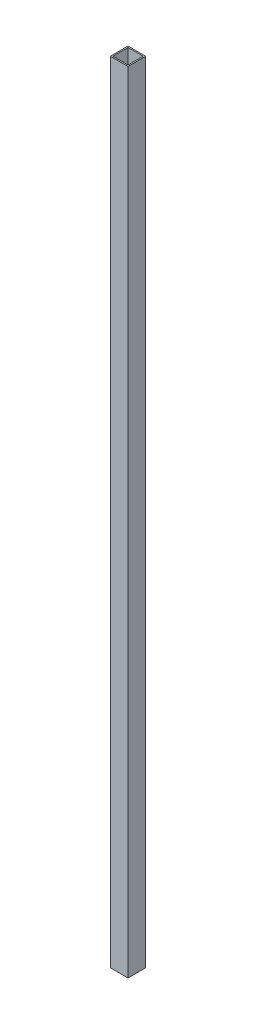
ISO-10303-21;
HEADER;
FILE_DESCRIPTION(('STEP AP214'),'2;1');
FILE_NAME('part.step','',(''),(''),'','','');
FILE_SCHEMA(('AUTOMOTIVE_DESIGN { 1 0 10303 214 1 1 1 1 }'));
ENDSEC;
DATA;
#1=APPLICATION_CONTEXT('core data for automotive mechanical design processes');
#2=APPLICATION_PROTOCOL_DEFINITION('international standard','automotive_design',2000,#1);
#3=PRODUCT_CONTEXT('',#1,'mechanical');
#4=PRODUCT('Part','Part','',(#3));
#5=PRODUCT_RELATED_PRODUCT_CATEGORY('part','',(#4));
#6=PRODUCT_DEFINITION_FORMATION('','',#4);
#7=PRODUCT_DEFINITION_CONTEXT('part definition',#1,'design');
#8=PRODUCT_DEFINITION('design','',#6,#7);
#9=PRODUCT_DEFINITION_SHAPE('','',#8);
#10=(LENGTH_UNIT() NAMED_UNIT(*) SI_UNIT(.MILLI.,.METRE.));
#11=(NAMED_UNIT(*) PLANE_ANGLE_UNIT() SI_UNIT($,.RADIAN.));
#12=(NAMED_UNIT(*) SI_UNIT($,.STERADIAN.) SOLID_ANGLE_UNIT());
#13=UNCERTAINTY_MEASURE_WITH_UNIT(LENGTH_MEASURE(1.E-05),#10,'distance_accuracy_value','');
#14=(GEOMETRIC_REPRESENTATION_CONTEXT(3) GLOBAL_UNCERTAINTY_ASSIGNED_CONTEXT((#13)) GLOBAL_UNIT_ASSIGNED_CONTEXT((#10,
#11,#12)) REPRESENTATION_CONTEXT('',''));
#15=CARTESIAN_POINT('',(0.,0.,0.));
#16=DIRECTION('',(0.,0.,1.));
#17=DIRECTION('',(1.,0.,0.));
#18=AXIS2_PLACEMENT_3D('',#15,#16,#17);
#19=CARTESIAN_POINT('',(0.,1981.2,0.));
#20=DIRECTION('',(0.,-1.,0.));
#21=DIRECTION('',(0.,0.,1.));
#22=AXIS2_PLACEMENT_3D('',#19,#20,#21);
#23=PLANE('',#22);
#24=DIRECTION('',(0.,0.,-1.));
#25=VECTOR('',#24,1.);
#26=CARTESIAN_POINT('',(0.,1981.2,0.));
#27=LINE('',#26,#25);
#28=CARTESIAN_POINT('',(0.,1981.2,44.45));
#29=VERTEX_POINT('',#28);
#30=CARTESIAN_POINT('',(0.,1981.2,0.));
#31=VERTEX_POINT('',#30);
#32=EDGE_CURVE('E138',#29,#31,#27,.T.);
#33=ORIENTED_EDGE('',*,*,#32,.F.);
#34=DIRECTION('',(-1.,0.,0.));
#35=VECTOR('',#34,1.);
#36=CARTESIAN_POINT('',(0.,1981.2,44.45));
#37=LINE('',#36,#35);
#38=CARTESIAN_POINT('',(44.45,1981.2,44.45));
#39=VERTEX_POINT('',#38);
#40=EDGE_CURVE('E148',#39,#29,#37,.T.);
#41=ORIENTED_EDGE('',*,*,#40,.F.);
#42=DIRECTION('',(0.,0.,1.));
#43=VECTOR('',#42,1.);
#44=CARTESIAN_POINT('',(44.45,1981.2,0.));
#45=LINE('',#44,#43);
#46=CARTESIAN_POINT('',(44.45,1981.2,0.));
#47=VERTEX_POINT('',#46);
#48=EDGE_CURVE('E145',#47,#39,#45,.T.);
#49=ORIENTED_EDGE('',*,*,#48,.F.);
#50=DIRECTION('',(1.,0.,0.));
#51=VECTOR('',#50,1.);
#52=CARTESIAN_POINT('',(0.,1981.2,0.));
#53=LINE('',#52,#51);
#54=EDGE_CURVE('E141',#31,#47,#53,.T.);
#55=ORIENTED_EDGE('',*,*,#54,.F.);
#56=EDGE_LOOP('',(#33,#41,#49,#55));
#57=FACE_BOUND('',#56,.T.);
#58=DIRECTION('',(1.,0.,0.));
#59=VECTOR('',#58,1.);
#60=CARTESIAN_POINT('',(3.175,1981.2,3.175));
#61=LINE('',#60,#59);
#62=CARTESIAN_POINT('',(3.175,1981.2,3.175));
#63=VERTEX_POINT('',#62);
#64=CARTESIAN_POINT('',(41.275,1981.2,3.175));
#65=VERTEX_POINT('',#64);
#66=EDGE_CURVE('E106',#63,#65,#61,.T.);
#67=ORIENTED_EDGE('',*,*,#66,.T.);
#68=DIRECTION('',(0.,0.,1.));
#69=VECTOR('',#68,1.);
#70=CARTESIAN_POINT('',(41.275,1981.2,3.175));
#71=LINE('',#70,#69);
#72=CARTESIAN_POINT('',(41.275,1981.2,41.275));
#73=VERTEX_POINT('',#72);
#74=EDGE_CURVE('E115',#65,#73,#71,.T.);
#75=ORIENTED_EDGE('',*,*,#74,.T.);
#76=DIRECTION('',(-1.,0.,0.));
#77=VECTOR('',#76,1.);
#78=CARTESIAN_POINT('',(3.175,1981.2,41.275));
#79=LINE('',#78,#77);
#80=CARTESIAN_POINT('',(3.175,1981.2,41.275));
#81=VERTEX_POINT('',#80);
#82=EDGE_CURVE('E119',#73,#81,#79,.T.);
#83=ORIENTED_EDGE('',*,*,#82,.T.);
#84=DIRECTION('',(0.,0.,-1.));
#85=VECTOR('',#84,1.);
#86=CARTESIAN_POINT('',(3.175,1981.2,3.175));
#87=LINE('',#86,#85);
#88=EDGE_CURVE('E122',#81,#63,#87,.T.);
#89=ORIENTED_EDGE('',*,*,#88,.T.);
#90=EDGE_LOOP('',(#67,#75,#83,#89));
#91=FACE_BOUND('',#90,.T.);
#92=ADVANCED_FACE('F39',(#57,#91),#23,.F.);
#93=CARTESIAN_POINT('',(0.,0.,0.));
#94=DIRECTION('',(0.,-1.,0.));
#95=DIRECTION('',(0.,0.,1.));
#96=AXIS2_PLACEMENT_3D('',#93,#94,#95);
#97=PLANE('',#96);
#98=DIRECTION('',(0.,0.,-1.));
#99=VECTOR('',#98,1.);
#100=CARTESIAN_POINT('',(0.,0.,0.));
#101=LINE('',#100,#99);
#102=CARTESIAN_POINT('',(0.,0.,44.45));
#103=VERTEX_POINT('',#102);
#104=CARTESIAN_POINT('',(0.,0.,0.));
#105=VERTEX_POINT('',#104);
#106=EDGE_CURVE('E111',#103,#105,#101,.T.);
#107=ORIENTED_EDGE('',*,*,#106,.T.);
#108=DIRECTION('',(1.,0.,0.));
#109=VECTOR('',#108,1.);
#110=CARTESIAN_POINT('',(0.,0.,0.));
#111=LINE('',#110,#109);
#112=CARTESIAN_POINT('',(44.45,0.,0.));
#113=VERTEX_POINT('',#112);
#114=EDGE_CURVE('E154',#105,#113,#111,.T.);
#115=ORIENTED_EDGE('',*,*,#114,.T.);
#116=DIRECTION('',(0.,0.,1.));
#117=VECTOR('',#116,1.);
#118=CARTESIAN_POINT('',(44.45,0.,0.));
#119=LINE('',#118,#117);
#120=CARTESIAN_POINT('',(44.45,0.,44.45));
#121=VERTEX_POINT('',#120);
#122=EDGE_CURVE('E157',#113,#121,#119,.T.);
#123=ORIENTED_EDGE('',*,*,#122,.T.);
#124=DIRECTION('',(-1.,0.,0.));
#125=VECTOR('',#124,1.);
#126=CARTESIAN_POINT('',(0.,0.,44.45));
#127=LINE('',#126,#125);
#128=EDGE_CURVE('E142',#121,#103,#127,.T.);
#129=ORIENTED_EDGE('',*,*,#128,.T.);
#130=EDGE_LOOP('',(#107,#115,#123,#129));
#131=FACE_BOUND('',#130,.T.);
#132=DIRECTION('',(0.,0.,-1.));
#133=VECTOR('',#132,1.);
#134=CARTESIAN_POINT('',(3.175,0.,3.175));
#135=LINE('',#134,#133);
#136=CARTESIAN_POINT('',(3.175,0.,41.275));
#137=VERTEX_POINT('',#136);
#138=CARTESIAN_POINT('',(3.175,0.,3.175));
#139=VERTEX_POINT('',#138);
#140=EDGE_CURVE('E123',#137,#139,#135,.T.);
#141=ORIENTED_EDGE('',*,*,#140,.F.);
#142=DIRECTION('',(-1.,0.,0.));
#143=VECTOR('',#142,1.);
#144=CARTESIAN_POINT('',(3.175,0.,41.275));
#145=LINE('',#144,#143);
#146=CARTESIAN_POINT('',(41.275,0.,41.275));
#147=VERTEX_POINT('',#146);
#148=EDGE_CURVE('E126',#147,#137,#145,.T.);
#149=ORIENTED_EDGE('',*,*,#148,.F.);
#150=DIRECTION('',(0.,0.,1.));
#151=VECTOR('',#150,1.);
#152=CARTESIAN_POINT('',(41.275,0.,3.175));
#153=LINE('',#152,#151);
#154=CARTESIAN_POINT('',(41.275,0.,3.175));
#155=VERTEX_POINT('',#154);
#156=EDGE_CURVE('E132',#155,#147,#153,.T.);
#157=ORIENTED_EDGE('',*,*,#156,.F.);
#158=DIRECTION('',(1.,0.,0.));
#159=VECTOR('',#158,1.);
#160=CARTESIAN_POINT('',(3.175,0.,3.175));
#161=LINE('',#160,#159);
#162=EDGE_CURVE('E107',#139,#155,#161,.T.);
#163=ORIENTED_EDGE('',*,*,#162,.F.);
#164=EDGE_LOOP('',(#141,#149,#157,#163));
#165=FACE_BOUND('',#164,.T.);
#166=ADVANCED_FACE('F174',(#131,#165),#97,.T.);
#167=CARTESIAN_POINT('',(0.,1981.2,0.));
#168=DIRECTION('',(1.,0.,0.));
#169=DIRECTION('',(0.,0.,1.));
#170=AXIS2_PLACEMENT_3D('',#167,#168,#169);
#171=PLANE('',#170);
#172=ORIENTED_EDGE('',*,*,#106,.F.);
#173=DIRECTION('',(0.,-1.,0.));
#174=VECTOR('',#173,1.);
#175=CARTESIAN_POINT('',(0.,1981.2,44.45));
#176=LINE('',#175,#174);
#177=EDGE_CURVE('E151',#29,#103,#176,.T.);
#178=ORIENTED_EDGE('',*,*,#177,.F.);
#179=ORIENTED_EDGE('',*,*,#32,.T.);
#180=DIRECTION('',(0.,-1.,0.));
#181=VECTOR('',#180,1.);
#182=CARTESIAN_POINT('',(0.,1981.2,0.));
#183=LINE('',#182,#181);
#184=EDGE_CURVE('E11',#31,#105,#183,.T.);
#185=ORIENTED_EDGE('',*,*,#184,.T.);
#186=EDGE_LOOP('',(#172,#178,#179,#185));
#187=FACE_BOUND('',#186,.T.);
#188=ADVANCED_FACE('F41',(#187),#171,.F.);
#189=CARTESIAN_POINT('',(0.,1981.2,0.));
#190=DIRECTION('',(0.,0.,1.));
#191=DIRECTION('',(-1.,0.,0.));
#192=AXIS2_PLACEMENT_3D('',#189,#190,#191);
#193=PLANE('',#192);
#194=ORIENTED_EDGE('',*,*,#114,.F.);
#195=ORIENTED_EDGE('',*,*,#184,.F.);
#196=ORIENTED_EDGE('',*,*,#54,.T.);
#197=DIRECTION('',(0.,-1.,0.));
#198=VECTOR('',#197,1.);
#199=CARTESIAN_POINT('',(44.45,1981.2,0.));
#200=LINE('',#199,#198);
#201=EDGE_CURVE('E47',#47,#113,#200,.T.);
#202=ORIENTED_EDGE('',*,*,#201,.T.);
#203=EDGE_LOOP('',(#194,#195,#196,#202));
#204=FACE_BOUND('',#203,.T.);
#205=ADVANCED_FACE('F167',(#204),#193,.F.);
#206=CARTESIAN_POINT('',(44.45,1981.2,0.));
#207=DIRECTION('',(-1.,0.,0.));
#208=DIRECTION('',(0.,0.,-1.));
#209=AXIS2_PLACEMENT_3D('',#206,#207,#208);
#210=PLANE('',#209);
#211=ORIENTED_EDGE('',*,*,#122,.F.);
#212=ORIENTED_EDGE('',*,*,#201,.F.);
#213=ORIENTED_EDGE('',*,*,#48,.T.);
#214=DIRECTION('',(0.,-1.,0.));
#215=VECTOR('',#214,1.);
#216=CARTESIAN_POINT('',(44.45,1981.2,44.45));
#217=LINE('',#216,#215);
#218=EDGE_CURVE('E163',#39,#121,#217,.T.);
#219=ORIENTED_EDGE('',*,*,#218,.T.);
#220=EDGE_LOOP('',(#211,#212,#213,#219));
#221=FACE_BOUND('',#220,.T.);
#222=ADVANCED_FACE('F171',(#221),#210,.F.);
#223=CARTESIAN_POINT('',(0.,1981.2,44.45));
#224=DIRECTION('',(0.,0.,-1.));
#225=DIRECTION('',(1.,0.,0.));
#226=AXIS2_PLACEMENT_3D('',#223,#224,#225);
#227=PLANE('',#226);
#228=ORIENTED_EDGE('',*,*,#128,.F.);
#229=ORIENTED_EDGE('',*,*,#218,.F.);
#230=ORIENTED_EDGE('',*,*,#40,.T.);
#231=ORIENTED_EDGE('',*,*,#177,.T.);
#232=EDGE_LOOP('',(#228,#229,#230,#231));
#233=FACE_BOUND('',#232,.T.);
#234=ADVANCED_FACE('F182',(#233),#227,.F.);
#235=CARTESIAN_POINT('',(3.175,1981.2,3.175));
#236=DIRECTION('',(0.,0.,1.));
#237=DIRECTION('',(-1.,0.,0.));
#238=AXIS2_PLACEMENT_3D('',#235,#236,#237);
#239=PLANE('',#238);
#240=ORIENTED_EDGE('',*,*,#162,.T.);
#241=DIRECTION('',(0.,-1.,0.));
#242=VECTOR('',#241,1.);
#243=CARTESIAN_POINT('',(41.275,1981.2,3.175));
#244=LINE('',#243,#242);
#245=EDGE_CURVE('E102',#65,#155,#244,.T.);
#246=ORIENTED_EDGE('',*,*,#245,.F.);
#247=ORIENTED_EDGE('',*,*,#66,.F.);
#248=DIRECTION('',(0.,-1.,0.));
#249=VECTOR('',#248,1.);
#250=CARTESIAN_POINT('',(3.175,1981.2,3.175));
#251=LINE('',#250,#249);
#252=EDGE_CURVE('E62',#63,#139,#251,.T.);
#253=ORIENTED_EDGE('',*,*,#252,.T.);
#254=EDGE_LOOP('',(#240,#246,#247,#253));
#255=FACE_BOUND('',#254,.T.);
#256=ADVANCED_FACE('F104',(#255),#239,.T.);
#257=CARTESIAN_POINT('',(41.275,1981.2,3.175));
#258=DIRECTION('',(-1.,0.,0.));
#259=DIRECTION('',(0.,0.,-1.));
#260=AXIS2_PLACEMENT_3D('',#257,#258,#259);
#261=PLANE('',#260);
#262=ORIENTED_EDGE('',*,*,#156,.T.);
#263=DIRECTION('',(0.,-1.,0.));
#264=VECTOR('',#263,1.);
#265=CARTESIAN_POINT('',(41.275,1981.2,41.275));
#266=LINE('',#265,#264);
#267=EDGE_CURVE('E112',#73,#147,#266,.T.);
#268=ORIENTED_EDGE('',*,*,#267,.F.);
#269=ORIENTED_EDGE('',*,*,#74,.F.);
#270=ORIENTED_EDGE('',*,*,#245,.T.);
#271=EDGE_LOOP('',(#262,#268,#269,#270));
#272=FACE_BOUND('',#271,.T.);
#273=ADVANCED_FACE('F116',(#272),#261,.T.);
#274=CARTESIAN_POINT('',(3.175,1981.2,41.275));
#275=DIRECTION('',(0.,0.,-1.));
#276=DIRECTION('',(1.,0.,0.));
#277=AXIS2_PLACEMENT_3D('',#274,#275,#276);
#278=PLANE('',#277);
#279=ORIENTED_EDGE('',*,*,#148,.T.);
#280=DIRECTION('',(0.,-1.,0.));
#281=VECTOR('',#280,1.);
#282=CARTESIAN_POINT('',(3.175,1981.2,41.275));
#283=LINE('',#282,#281);
#284=EDGE_CURVE('E54',#81,#137,#283,.T.);
#285=ORIENTED_EDGE('',*,*,#284,.F.);
#286=ORIENTED_EDGE('',*,*,#82,.F.);
#287=ORIENTED_EDGE('',*,*,#267,.T.);
#288=EDGE_LOOP('',(#279,#285,#286,#287));
#289=FACE_BOUND('',#288,.T.);
#290=ADVANCED_FACE('F200',(#289),#278,.T.);
#291=CARTESIAN_POINT('',(3.175,1981.2,3.175));
#292=DIRECTION('',(1.,0.,0.));
#293=DIRECTION('',(0.,0.,1.));
#294=AXIS2_PLACEMENT_3D('',#291,#292,#293);
#295=PLANE('',#294);
#296=ORIENTED_EDGE('',*,*,#140,.T.);
#297=ORIENTED_EDGE('',*,*,#252,.F.);
#298=ORIENTED_EDGE('',*,*,#88,.F.);
#299=ORIENTED_EDGE('',*,*,#284,.T.);
#300=EDGE_LOOP('',(#296,#297,#298,#299));
#301=FACE_BOUND('',#300,.T.);
#302=ADVANCED_FACE('F203',(#301),#295,.T.);
#303=CLOSED_SHELL('',(#92,#166,#188,#205,#222,#234,#256,#273,#290,#302));
#304=MANIFOLD_SOLID_BREP('B2',#303);
#305=ADVANCED_BREP_SHAPE_REPRESENTATION('',(#18,#304),#14);
#306=SHAPE_DEFINITION_REPRESENTATION(#9,#305);
ENDSEC;
END-ISO-10303-21;
